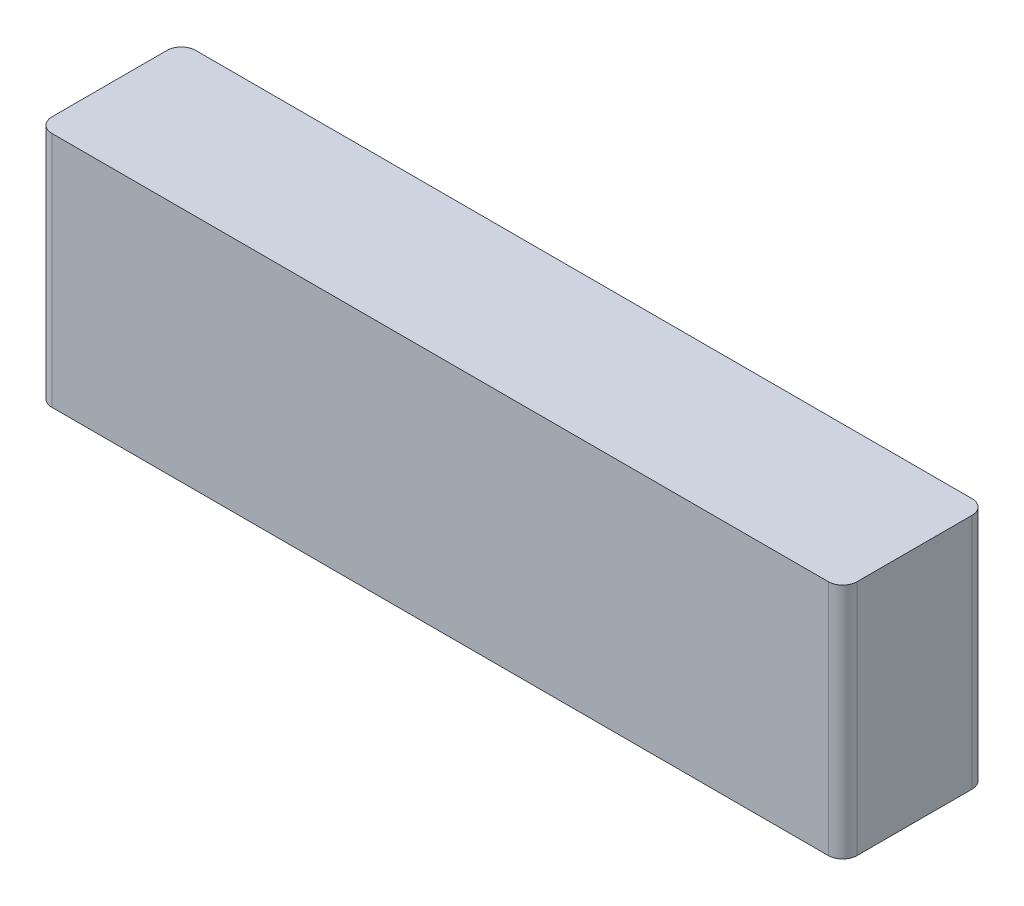
ISO-10303-21;
HEADER;
FILE_DESCRIPTION(('STEP AP214'),'2;1');
FILE_NAME('part.step','',(''),(''),'','','');
FILE_SCHEMA(('AUTOMOTIVE_DESIGN { 1 0 10303 214 1 1 1 1 }'));
ENDSEC;
DATA;
#1=APPLICATION_CONTEXT('core data for automotive mechanical design processes');
#2=APPLICATION_PROTOCOL_DEFINITION('international standard','automotive_design',2000,#1);
#3=PRODUCT_CONTEXT('',#1,'mechanical');
#4=PRODUCT('Part','Part','',(#3));
#5=PRODUCT_RELATED_PRODUCT_CATEGORY('part','',(#4));
#6=PRODUCT_DEFINITION_FORMATION('','',#4);
#7=PRODUCT_DEFINITION_CONTEXT('part definition',#1,'design');
#8=PRODUCT_DEFINITION('design','',#6,#7);
#9=PRODUCT_DEFINITION_SHAPE('','',#8);
#10=(LENGTH_UNIT() NAMED_UNIT(*) SI_UNIT(.MILLI.,.METRE.));
#11=(NAMED_UNIT(*) PLANE_ANGLE_UNIT() SI_UNIT($,.RADIAN.));
#12=(NAMED_UNIT(*) SI_UNIT($,.STERADIAN.) SOLID_ANGLE_UNIT());
#13=UNCERTAINTY_MEASURE_WITH_UNIT(LENGTH_MEASURE(1.E-05),#10,'distance_accuracy_value','');
#14=(GEOMETRIC_REPRESENTATION_CONTEXT(3) GLOBAL_UNCERTAINTY_ASSIGNED_CONTEXT((#13)) GLOBAL_UNIT_ASSIGNED_CONTEXT((#10,
#11,#12)) REPRESENTATION_CONTEXT('',''));
#15=CARTESIAN_POINT('',(0.,0.,0.));
#16=DIRECTION('',(0.,0.,1.));
#17=DIRECTION('',(1.,0.,0.));
#18=AXIS2_PLACEMENT_3D('',#15,#16,#17);
#19=CARTESIAN_POINT('',(56.,33.,10.));
#20=DIRECTION('',(-1.,0.,0.));
#21=DIRECTION('',(0.,0.,1.));
#22=AXIS2_PLACEMENT_3D('',#19,#20,#21);
#23=PLANE('',#22);
#24=DIRECTION('',(0.,0.,-1.));
#25=VECTOR('',#24,1.);
#26=CARTESIAN_POINT('',(56.,0.,10.));
#27=LINE('',#26,#25);
#28=CARTESIAN_POINT('',(56.,0.,8.));
#29=VERTEX_POINT('',#28);
#30=CARTESIAN_POINT('',(56.,0.,-8.));
#31=VERTEX_POINT('',#30);
#32=EDGE_CURVE('E157',#29,#31,#27,.T.);
#33=ORIENTED_EDGE('',*,*,#32,.T.);
#34=DIRECTION('',(0.,-1.,0.));
#35=VECTOR('',#34,1.);
#36=CARTESIAN_POINT('',(56.,33.,-8.));
#37=LINE('',#36,#35);
#38=CARTESIAN_POINT('',(56.,33.,-8.));
#39=VERTEX_POINT('',#38);
#40=EDGE_CURVE('E11',#31,#39,#37,.F.);
#41=ORIENTED_EDGE('',*,*,#40,.T.);
#42=DIRECTION('',(0.,0.,-1.));
#43=VECTOR('',#42,1.);
#44=CARTESIAN_POINT('',(56.,33.,10.));
#45=LINE('',#44,#43);
#46=CARTESIAN_POINT('',(56.,33.,8.));
#47=VERTEX_POINT('',#46);
#48=EDGE_CURVE('E125',#47,#39,#45,.T.);
#49=ORIENTED_EDGE('',*,*,#48,.F.);
#50=DIRECTION('',(0.,-1.,0.));
#51=VECTOR('',#50,1.);
#52=CARTESIAN_POINT('',(56.,33.,8.));
#53=LINE('',#52,#51);
#54=EDGE_CURVE('E41',#47,#29,#53,.T.);
#55=ORIENTED_EDGE('',*,*,#54,.T.);
#56=EDGE_LOOP('',(#33,#41,#49,#55));
#57=FACE_BOUND('',#56,.T.);
#58=ADVANCED_FACE('F33',(#57),#23,.F.);
#59=CARTESIAN_POINT('',(-56.,33.,-10.));
#60=DIRECTION('',(0.,0.,1.));
#61=DIRECTION('',(1.,0.,0.));
#62=AXIS2_PLACEMENT_3D('',#59,#60,#61);
#63=PLANE('',#62);
#64=DIRECTION('',(-1.,0.,0.));
#65=VECTOR('',#64,1.);
#66=CARTESIAN_POINT('',(-56.,0.,-10.));
#67=LINE('',#66,#65);
#68=CARTESIAN_POINT('',(54.,0.,-10.));
#69=VERTEX_POINT('',#68);
#70=CARTESIAN_POINT('',(-54.,0.,-10.));
#71=VERTEX_POINT('',#70);
#72=EDGE_CURVE('E130',#69,#71,#67,.T.);
#73=ORIENTED_EDGE('',*,*,#72,.T.);
#74=DIRECTION('',(0.,-1.,0.));
#75=VECTOR('',#74,1.);
#76=CARTESIAN_POINT('',(-54.,33.,-10.));
#77=LINE('',#76,#75);
#78=CARTESIAN_POINT('',(-54.,33.,-10.));
#79=VERTEX_POINT('',#78);
#80=EDGE_CURVE('E48',#71,#79,#77,.F.);
#81=ORIENTED_EDGE('',*,*,#80,.T.);
#82=DIRECTION('',(-1.,0.,0.));
#83=VECTOR('',#82,1.);
#84=CARTESIAN_POINT('',(-56.,33.,-10.));
#85=LINE('',#84,#83);
#86=CARTESIAN_POINT('',(54.,33.,-10.));
#87=VERTEX_POINT('',#86);
#88=EDGE_CURVE('E128',#87,#79,#85,.T.);
#89=ORIENTED_EDGE('',*,*,#88,.F.);
#90=DIRECTION('',(0.,-1.,0.));
#91=VECTOR('',#90,1.);
#92=CARTESIAN_POINT('',(54.,33.,-10.));
#93=LINE('',#92,#91);
#94=EDGE_CURVE('E149',#87,#69,#93,.T.);
#95=ORIENTED_EDGE('',*,*,#94,.T.);
#96=EDGE_LOOP('',(#73,#81,#89,#95));
#97=FACE_BOUND('',#96,.T.);
#98=ADVANCED_FACE('F177',(#97),#63,.F.);
#99=CARTESIAN_POINT('',(-56.,33.,10.));
#100=DIRECTION('',(1.,0.,0.));
#101=DIRECTION('',(0.,0.,-1.));
#102=AXIS2_PLACEMENT_3D('',#99,#100,#101);
#103=PLANE('',#102);
#104=DIRECTION('',(0.,0.,1.));
#105=VECTOR('',#104,1.);
#106=CARTESIAN_POINT('',(-56.,0.,10.));
#107=LINE('',#106,#105);
#108=CARTESIAN_POINT('',(-56.,0.,-8.));
#109=VERTEX_POINT('',#108);
#110=CARTESIAN_POINT('',(-56.,0.,8.));
#111=VERTEX_POINT('',#110);
#112=EDGE_CURVE('E126',#109,#111,#107,.T.);
#113=ORIENTED_EDGE('',*,*,#112,.T.);
#114=DIRECTION('',(0.,-1.,0.));
#115=VECTOR('',#114,1.);
#116=CARTESIAN_POINT('',(-56.,33.,8.));
#117=LINE('',#116,#115);
#118=CARTESIAN_POINT('',(-56.,33.,8.));
#119=VERTEX_POINT('',#118);
#120=EDGE_CURVE('E104',#111,#119,#117,.F.);
#121=ORIENTED_EDGE('',*,*,#120,.T.);
#122=DIRECTION('',(0.,0.,1.));
#123=VECTOR('',#122,1.);
#124=CARTESIAN_POINT('',(-56.,33.,10.));
#125=LINE('',#124,#123);
#126=CARTESIAN_POINT('',(-56.,33.,-8.));
#127=VERTEX_POINT('',#126);
#128=EDGE_CURVE('E165',#127,#119,#125,.T.);
#129=ORIENTED_EDGE('',*,*,#128,.F.);
#130=DIRECTION('',(0.,-1.,0.));
#131=VECTOR('',#130,1.);
#132=CARTESIAN_POINT('',(-56.,33.,-8.));
#133=LINE('',#132,#131);
#134=EDGE_CURVE('E109',#127,#109,#133,.T.);
#135=ORIENTED_EDGE('',*,*,#134,.T.);
#136=EDGE_LOOP('',(#113,#121,#129,#135));
#137=FACE_BOUND('',#136,.T.);
#138=ADVANCED_FACE('F176',(#137),#103,.F.);
#139=CARTESIAN_POINT('',(-56.,33.,10.));
#140=DIRECTION('',(0.,0.,-1.));
#141=DIRECTION('',(-1.,0.,0.));
#142=AXIS2_PLACEMENT_3D('',#139,#140,#141);
#143=PLANE('',#142);
#144=DIRECTION('',(1.,0.,0.));
#145=VECTOR('',#144,1.);
#146=CARTESIAN_POINT('',(-56.,33.,10.));
#147=LINE('',#146,#145);
#148=CARTESIAN_POINT('',(-54.,33.,10.));
#149=VERTEX_POINT('',#148);
#150=CARTESIAN_POINT('',(54.,33.,10.));
#151=VERTEX_POINT('',#150);
#152=EDGE_CURVE('E119',#149,#151,#147,.T.);
#153=ORIENTED_EDGE('',*,*,#152,.F.);
#154=DIRECTION('',(0.,-1.,0.));
#155=VECTOR('',#154,1.);
#156=CARTESIAN_POINT('',(-54.,33.,10.));
#157=LINE('',#156,#155);
#158=CARTESIAN_POINT('',(-54.,0.,10.));
#159=VERTEX_POINT('',#158);
#160=EDGE_CURVE('E103',#149,#159,#157,.T.);
#161=ORIENTED_EDGE('',*,*,#160,.T.);
#162=DIRECTION('',(1.,0.,0.));
#163=VECTOR('',#162,1.);
#164=CARTESIAN_POINT('',(-56.,0.,10.));
#165=LINE('',#164,#163);
#166=CARTESIAN_POINT('',(54.,0.,10.));
#167=VERTEX_POINT('',#166);
#168=EDGE_CURVE('E116',#159,#167,#165,.T.);
#169=ORIENTED_EDGE('',*,*,#168,.T.);
#170=DIRECTION('',(0.,-1.,0.));
#171=VECTOR('',#170,1.);
#172=CARTESIAN_POINT('',(54.,33.,10.));
#173=LINE('',#172,#171);
#174=EDGE_CURVE('E121',#167,#151,#173,.F.);
#175=ORIENTED_EDGE('',*,*,#174,.T.);
#176=EDGE_LOOP('',(#153,#161,#169,#175));
#177=FACE_BOUND('',#176,.T.);
#178=ADVANCED_FACE('F115',(#177),#143,.F.);
#179=CARTESIAN_POINT('',(0.,33.,0.));
#180=DIRECTION('',(0.,-1.,0.));
#181=DIRECTION('',(0.,0.,-1.));
#182=AXIS2_PLACEMENT_3D('',#179,#180,#181);
#183=PLANE('',#182);
#184=ORIENTED_EDGE('',*,*,#128,.T.);
#185=CARTESIAN_POINT('',(-54.,33.,8.));
#186=DIRECTION('',(0.,-1.,0.));
#187=DIRECTION('',(0.,0.,-1.));
#188=AXIS2_PLACEMENT_3D('',#185,#186,#187);
#189=CIRCLE('',#188,2.);
#190=EDGE_CURVE('E147',#119,#149,#189,.F.);
#191=ORIENTED_EDGE('',*,*,#190,.T.);
#192=ORIENTED_EDGE('',*,*,#152,.T.);
#193=CARTESIAN_POINT('',(54.,33.,8.));
#194=DIRECTION('',(0.,-1.,0.));
#195=DIRECTION('',(0.,0.,-1.));
#196=AXIS2_PLACEMENT_3D('',#193,#194,#195);
#197=CIRCLE('',#196,2.);
#198=EDGE_CURVE('E142',#151,#47,#197,.F.);
#199=ORIENTED_EDGE('',*,*,#198,.T.);
#200=ORIENTED_EDGE('',*,*,#48,.T.);
#201=CARTESIAN_POINT('',(54.,33.,-8.));
#202=DIRECTION('',(0.,-1.,0.));
#203=DIRECTION('',(0.,0.,-1.));
#204=AXIS2_PLACEMENT_3D('',#201,#202,#203);
#205=CIRCLE('',#204,2.);
#206=EDGE_CURVE('E55',#39,#87,#205,.F.);
#207=ORIENTED_EDGE('',*,*,#206,.T.);
#208=ORIENTED_EDGE('',*,*,#88,.T.);
#209=CARTESIAN_POINT('',(-54.,33.,-8.));
#210=DIRECTION('',(0.,-1.,0.));
#211=DIRECTION('',(0.,0.,-1.));
#212=AXIS2_PLACEMENT_3D('',#209,#210,#211);
#213=CIRCLE('',#212,2.);
#214=EDGE_CURVE('E145',#79,#127,#213,.F.);
#215=ORIENTED_EDGE('',*,*,#214,.T.);
#216=EDGE_LOOP('',(#184,#191,#192,#199,#200,#207,#208,#215));
#217=FACE_BOUND('',#216,.T.);
#218=ADVANCED_FACE('F169',(#217),#183,.F.);
#219=CARTESIAN_POINT('',(0.,0.,0.));
#220=DIRECTION('',(0.,-1.,0.));
#221=DIRECTION('',(0.,0.,-1.));
#222=AXIS2_PLACEMENT_3D('',#219,#220,#221);
#223=PLANE('',#222);
#224=ORIENTED_EDGE('',*,*,#168,.F.);
#225=CARTESIAN_POINT('',(-54.,0.,8.));
#226=DIRECTION('',(0.,-1.,0.));
#227=DIRECTION('',(0.,0.,-1.));
#228=AXIS2_PLACEMENT_3D('',#225,#226,#227);
#229=CIRCLE('',#228,2.);
#230=EDGE_CURVE('E99',#159,#111,#229,.T.);
#231=ORIENTED_EDGE('',*,*,#230,.T.);
#232=ORIENTED_EDGE('',*,*,#112,.F.);
#233=CARTESIAN_POINT('',(-54.,0.,-8.));
#234=DIRECTION('',(0.,-1.,0.));
#235=DIRECTION('',(0.,0.,-1.));
#236=AXIS2_PLACEMENT_3D('',#233,#234,#235);
#237=CIRCLE('',#236,2.);
#238=EDGE_CURVE('E110',#109,#71,#237,.T.);
#239=ORIENTED_EDGE('',*,*,#238,.T.);
#240=ORIENTED_EDGE('',*,*,#72,.F.);
#241=CARTESIAN_POINT('',(54.,0.,-8.));
#242=DIRECTION('',(0.,-1.,0.));
#243=DIRECTION('',(0.,0.,-1.));
#244=AXIS2_PLACEMENT_3D('',#241,#242,#243);
#245=CIRCLE('',#244,2.);
#246=EDGE_CURVE('E136',#69,#31,#245,.T.);
#247=ORIENTED_EDGE('',*,*,#246,.T.);
#248=ORIENTED_EDGE('',*,*,#32,.F.);
#249=CARTESIAN_POINT('',(54.,0.,8.));
#250=DIRECTION('',(0.,-1.,0.));
#251=DIRECTION('',(0.,0.,-1.));
#252=AXIS2_PLACEMENT_3D('',#249,#250,#251);
#253=CIRCLE('',#252,2.);
#254=EDGE_CURVE('E120',#29,#167,#253,.T.);
#255=ORIENTED_EDGE('',*,*,#254,.T.);
#256=EDGE_LOOP('',(#224,#231,#232,#239,#240,#247,#248,#255));
#257=FACE_BOUND('',#256,.T.);
#258=ADVANCED_FACE('F123',(#257),#223,.T.);
#259=CARTESIAN_POINT('',(-54.,33.,8.));
#260=DIRECTION('',(0.,-1.,0.));
#261=DIRECTION('',(0.,0.,-1.));
#262=AXIS2_PLACEMENT_3D('',#259,#260,#261);
#263=CYLINDRICAL_SURFACE('',#262,2.);
#264=ORIENTED_EDGE('',*,*,#190,.F.);
#265=ORIENTED_EDGE('',*,*,#120,.F.);
#266=ORIENTED_EDGE('',*,*,#230,.F.);
#267=ORIENTED_EDGE('',*,*,#160,.F.);
#268=EDGE_LOOP('',(#264,#265,#266,#267));
#269=FACE_BOUND('',#268,.T.);
#270=ADVANCED_FACE('F102',(#269),#263,.T.);
#271=CARTESIAN_POINT('',(-54.,33.,-8.));
#272=DIRECTION('',(0.,-1.,0.));
#273=DIRECTION('',(0.,0.,-1.));
#274=AXIS2_PLACEMENT_3D('',#271,#272,#273);
#275=CYLINDRICAL_SURFACE('',#274,2.);
#276=ORIENTED_EDGE('',*,*,#214,.F.);
#277=ORIENTED_EDGE('',*,*,#80,.F.);
#278=ORIENTED_EDGE('',*,*,#238,.F.);
#279=ORIENTED_EDGE('',*,*,#134,.F.);
#280=EDGE_LOOP('',(#276,#277,#278,#279));
#281=FACE_BOUND('',#280,.T.);
#282=ADVANCED_FACE('F174',(#281),#275,.T.);
#283=CARTESIAN_POINT('',(54.,33.,-8.));
#284=DIRECTION('',(0.,-1.,0.));
#285=DIRECTION('',(0.,0.,-1.));
#286=AXIS2_PLACEMENT_3D('',#283,#284,#285);
#287=CYLINDRICAL_SURFACE('',#286,2.);
#288=ORIENTED_EDGE('',*,*,#206,.F.);
#289=ORIENTED_EDGE('',*,*,#40,.F.);
#290=ORIENTED_EDGE('',*,*,#246,.F.);
#291=ORIENTED_EDGE('',*,*,#94,.F.);
#292=EDGE_LOOP('',(#288,#289,#290,#291));
#293=FACE_BOUND('',#292,.T.);
#294=ADVANCED_FACE('F179',(#293),#287,.T.);
#295=CARTESIAN_POINT('',(54.,33.,8.));
#296=DIRECTION('',(0.,-1.,0.));
#297=DIRECTION('',(0.,0.,-1.));
#298=AXIS2_PLACEMENT_3D('',#295,#296,#297);
#299=CYLINDRICAL_SURFACE('',#298,2.);
#300=ORIENTED_EDGE('',*,*,#198,.F.);
#301=ORIENTED_EDGE('',*,*,#174,.F.);
#302=ORIENTED_EDGE('',*,*,#254,.F.);
#303=ORIENTED_EDGE('',*,*,#54,.F.);
#304=EDGE_LOOP('',(#300,#301,#302,#303));
#305=FACE_BOUND('',#304,.T.);
#306=ADVANCED_FACE('F35',(#305),#299,.T.);
#307=CLOSED_SHELL('',(#58,#98,#138,#178,#218,#258,#270,#282,#294,#306));
#308=MANIFOLD_SOLID_BREP('B2',#307);
#309=ADVANCED_BREP_SHAPE_REPRESENTATION('',(#18,#308),#14);
#310=SHAPE_DEFINITION_REPRESENTATION(#9,#309);
ENDSEC;
END-ISO-10303-21;
